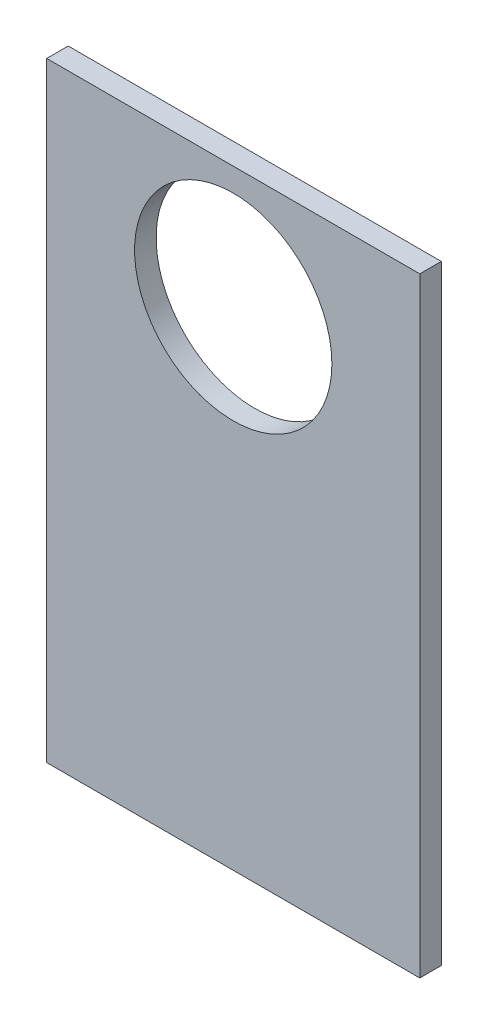
ISO-10303-21;
HEADER;
FILE_DESCRIPTION(('STEP AP214'),'2;1');
FILE_NAME('part.step','',(''),(''),'','','');
FILE_SCHEMA(('AUTOMOTIVE_DESIGN { 1 0 10303 214 1 1 1 1 }'));
ENDSEC;
DATA;
#1=APPLICATION_CONTEXT('core data for automotive mechanical design processes');
#2=APPLICATION_PROTOCOL_DEFINITION('international standard','automotive_design',2000,#1);
#3=PRODUCT_CONTEXT('',#1,'mechanical');
#4=PRODUCT('Part','Part','',(#3));
#5=PRODUCT_RELATED_PRODUCT_CATEGORY('part','',(#4));
#6=PRODUCT_DEFINITION_FORMATION('','',#4);
#7=PRODUCT_DEFINITION_CONTEXT('part definition',#1,'design');
#8=PRODUCT_DEFINITION('design','',#6,#7);
#9=PRODUCT_DEFINITION_SHAPE('','',#8);
#10=(LENGTH_UNIT() NAMED_UNIT(*) SI_UNIT(.MILLI.,.METRE.));
#11=(NAMED_UNIT(*) PLANE_ANGLE_UNIT() SI_UNIT($,.RADIAN.));
#12=(NAMED_UNIT(*) SI_UNIT($,.STERADIAN.) SOLID_ANGLE_UNIT());
#13=UNCERTAINTY_MEASURE_WITH_UNIT(LENGTH_MEASURE(1.E-05),#10,'distance_accuracy_value','');
#14=(GEOMETRIC_REPRESENTATION_CONTEXT(3) GLOBAL_UNCERTAINTY_ASSIGNED_CONTEXT((#13)) GLOBAL_UNIT_ASSIGNED_CONTEXT((#10,
#11,#12)) REPRESENTATION_CONTEXT('',''));
#15=CARTESIAN_POINT('',(0.,0.,0.));
#16=DIRECTION('',(0.,0.,1.));
#17=DIRECTION('',(1.,0.,0.));
#18=AXIS2_PLACEMENT_3D('',#15,#16,#17);
#19=CARTESIAN_POINT('',(26.0000000000001,-10.,33.));
#20=DIRECTION('',(1.,0.,0.));
#21=DIRECTION('',(0.,1.,0.));
#22=AXIS2_PLACEMENT_3D('',#19,#20,#21);
#23=PLANE('',#22);
#24=DIRECTION('',(0.,0.,1.));
#25=VECTOR('',#24,1.);
#26=CARTESIAN_POINT('',(26.0000000000001,-95.,33.));
#27=LINE('',#26,#25);
#28=CARTESIAN_POINT('',(26.0000000000001,-95.,30.));
#29=VERTEX_POINT('',#28);
#30=CARTESIAN_POINT('',(26.0000000000001,-95.,33.));
#31=VERTEX_POINT('',#30);
#32=EDGE_CURVE('E11',#29,#31,#27,.T.);
#33=ORIENTED_EDGE('',*,*,#32,.F.);
#34=DIRECTION('',(0.,1.,0.));
#35=VECTOR('',#34,1.);
#36=CARTESIAN_POINT('',(26.0000000000001,0.,30.));
#37=LINE('',#36,#35);
#38=CARTESIAN_POINT('',(26.0000000000001,-10.,30.));
#39=VERTEX_POINT('',#38);
#40=EDGE_CURVE('E93',#29,#39,#37,.T.);
#41=ORIENTED_EDGE('',*,*,#40,.T.);
#42=DIRECTION('',(0.,0.,1.));
#43=VECTOR('',#42,1.);
#44=CARTESIAN_POINT('',(26.0000000000001,-10.,33.));
#45=LINE('',#44,#43);
#46=CARTESIAN_POINT('',(26.0000000000001,-10.,33.));
#47=VERTEX_POINT('',#46);
#48=EDGE_CURVE('E47',#39,#47,#45,.T.);
#49=ORIENTED_EDGE('',*,*,#48,.T.);
#50=DIRECTION('',(0.,1.,0.));
#51=VECTOR('',#50,1.);
#52=CARTESIAN_POINT('',(26.0000000000001,-10.,33.));
#53=LINE('',#52,#51);
#54=EDGE_CURVE('E109',#31,#47,#53,.T.);
#55=ORIENTED_EDGE('',*,*,#54,.F.);
#56=EDGE_LOOP('',(#33,#41,#49,#55));
#57=FACE_BOUND('',#56,.T.);
#58=ADVANCED_FACE('F37',(#57),#23,.T.);
#59=CARTESIAN_POINT('',(-25.9999999999999,-10.,33.));
#60=DIRECTION('',(0.,1.,0.));
#61=DIRECTION('',(-1.,0.,0.));
#62=AXIS2_PLACEMENT_3D('',#59,#60,#61);
#63=PLANE('',#62);
#64=ORIENTED_EDGE('',*,*,#48,.F.);
#65=DIRECTION('',(1.,0.,0.));
#66=VECTOR('',#65,1.);
#67=CARTESIAN_POINT('',(0.,-10.,30.));
#68=LINE('',#67,#66);
#69=CARTESIAN_POINT('',(-25.9999999999999,-10.,30.));
#70=VERTEX_POINT('',#69);
#71=EDGE_CURVE('E100',#39,#70,#68,.F.);
#72=ORIENTED_EDGE('',*,*,#71,.T.);
#73=DIRECTION('',(0.,0.,1.));
#74=VECTOR('',#73,1.);
#75=CARTESIAN_POINT('',(-25.9999999999999,-10.,33.));
#76=LINE('',#75,#74);
#77=CARTESIAN_POINT('',(-25.9999999999999,-10.,33.));
#78=VERTEX_POINT('',#77);
#79=EDGE_CURVE('E55',#70,#78,#76,.T.);
#80=ORIENTED_EDGE('',*,*,#79,.T.);
#81=DIRECTION('',(-1.,0.,0.));
#82=VECTOR('',#81,1.);
#83=CARTESIAN_POINT('',(-25.9999999999999,-10.,33.));
#84=LINE('',#83,#82);
#85=EDGE_CURVE('E114',#47,#78,#84,.T.);
#86=ORIENTED_EDGE('',*,*,#85,.F.);
#87=EDGE_LOOP('',(#64,#72,#80,#86));
#88=FACE_BOUND('',#87,.T.);
#89=ADVANCED_FACE('F116',(#88),#63,.T.);
#90=CARTESIAN_POINT('',(-25.9999999999999,-10.,33.));
#91=DIRECTION('',(-1.,0.,0.));
#92=DIRECTION('',(0.,-1.,0.));
#93=AXIS2_PLACEMENT_3D('',#90,#91,#92);
#94=PLANE('',#93);
#95=ORIENTED_EDGE('',*,*,#79,.F.);
#96=DIRECTION('',(0.,1.,0.));
#97=VECTOR('',#96,1.);
#98=CARTESIAN_POINT('',(-25.9999999999999,0.,30.));
#99=LINE('',#98,#97);
#100=CARTESIAN_POINT('',(-25.9999999999999,-95.,30.));
#101=VERTEX_POINT('',#100);
#102=EDGE_CURVE('E92',#70,#101,#99,.F.);
#103=ORIENTED_EDGE('',*,*,#102,.T.);
#104=DIRECTION('',(0.,0.,1.));
#105=VECTOR('',#104,1.);
#106=CARTESIAN_POINT('',(-25.9999999999999,-95.,33.));
#107=LINE('',#106,#105);
#108=CARTESIAN_POINT('',(-25.9999999999999,-95.,33.));
#109=VERTEX_POINT('',#108);
#110=EDGE_CURVE('E41',#101,#109,#107,.T.);
#111=ORIENTED_EDGE('',*,*,#110,.T.);
#112=DIRECTION('',(0.,-1.,0.));
#113=VECTOR('',#112,1.);
#114=CARTESIAN_POINT('',(-25.9999999999999,-10.,33.));
#115=LINE('',#114,#113);
#116=EDGE_CURVE('E106',#78,#109,#115,.T.);
#117=ORIENTED_EDGE('',*,*,#116,.F.);
#118=EDGE_LOOP('',(#95,#103,#111,#117));
#119=FACE_BOUND('',#118,.T.);
#120=ADVANCED_FACE('F95',(#119),#94,.T.);
#121=CARTESIAN_POINT('',(-25.9999999999999,-95.,33.));
#122=DIRECTION('',(0.,-1.,0.));
#123=DIRECTION('',(1.,0.,0.));
#124=AXIS2_PLACEMENT_3D('',#121,#122,#123);
#125=PLANE('',#124);
#126=DIRECTION('',(1.,0.,0.));
#127=VECTOR('',#126,1.);
#128=CARTESIAN_POINT('',(0.,-95.,30.));
#129=LINE('',#128,#127);
#130=EDGE_CURVE('E80',#101,#29,#129,.T.);
#131=ORIENTED_EDGE('',*,*,#130,.T.);
#132=ORIENTED_EDGE('',*,*,#32,.T.);
#133=DIRECTION('',(1.,0.,0.));
#134=VECTOR('',#133,1.);
#135=CARTESIAN_POINT('',(-25.9999999999999,-95.,33.));
#136=LINE('',#135,#134);
#137=EDGE_CURVE('E82',#109,#31,#136,.T.);
#138=ORIENTED_EDGE('',*,*,#137,.F.);
#139=ORIENTED_EDGE('',*,*,#110,.F.);
#140=EDGE_LOOP('',(#131,#132,#138,#139));
#141=FACE_BOUND('',#140,.T.);
#142=ADVANCED_FACE('F79',(#141),#125,.T.);
#143=CARTESIAN_POINT('',(0.,-27.,33.));
#144=DIRECTION('',(0.,0.,1.));
#145=DIRECTION('',(1.,0.,0.));
#146=AXIS2_PLACEMENT_3D('',#143,#144,#145);
#147=CYLINDRICAL_SURFACE('',#146,13.75);
#148=CARTESIAN_POINT('',(0.,-27.,33.));
#149=DIRECTION('',(0.,0.,1.));
#150=DIRECTION('',(1.,0.,0.));
#151=AXIS2_PLACEMENT_3D('',#148,#149,#150);
#152=CIRCLE('',#151,13.75);
#153=CARTESIAN_POINT('',(13.75,-27.,33.));
#154=VERTEX_POINT('',#153);
#155=EDGE_CURVE('E86',#154,#154,#152,.T.);
#156=ORIENTED_EDGE('',*,*,#155,.T.);
#157=EDGE_LOOP('',(#156));
#158=FACE_BOUND('',#157,.T.);
#159=CARTESIAN_POINT('',(0.,-27.,30.));
#160=DIRECTION('',(0.,0.,1.));
#161=DIRECTION('',(1.,0.,0.));
#162=AXIS2_PLACEMENT_3D('',#159,#160,#161);
#163=CIRCLE('',#162,13.75);
#164=CARTESIAN_POINT('',(13.75,-27.,30.));
#165=VERTEX_POINT('',#164);
#166=EDGE_CURVE('E102',#165,#165,#163,.T.);
#167=ORIENTED_EDGE('',*,*,#166,.F.);
#168=EDGE_LOOP('',(#167));
#169=FACE_BOUND('',#168,.T.);
#170=ADVANCED_FACE('F39',(#158,#169),#147,.F.);
#171=CARTESIAN_POINT('',(0.,0.,33.));
#172=DIRECTION('',(0.,0.,1.));
#173=DIRECTION('',(1.,0.,0.));
#174=AXIS2_PLACEMENT_3D('',#171,#172,#173);
#175=PLANE('',#174);
#176=ORIENTED_EDGE('',*,*,#116,.T.);
#177=ORIENTED_EDGE('',*,*,#137,.T.);
#178=ORIENTED_EDGE('',*,*,#54,.T.);
#179=ORIENTED_EDGE('',*,*,#85,.T.);
#180=EDGE_LOOP('',(#176,#177,#178,#179));
#181=FACE_BOUND('',#180,.T.);
#182=ORIENTED_EDGE('',*,*,#155,.F.);
#183=EDGE_LOOP('',(#182));
#184=FACE_BOUND('',#183,.T.);
#185=ADVANCED_FACE('F112',(#181,#184),#175,.T.);
#186=CARTESIAN_POINT('',(0.,0.,30.));
#187=DIRECTION('',(0.,0.,1.));
#188=DIRECTION('',(1.,0.,0.));
#189=AXIS2_PLACEMENT_3D('',#186,#187,#188);
#190=PLANE('',#189);
#191=ORIENTED_EDGE('',*,*,#102,.F.);
#192=ORIENTED_EDGE('',*,*,#71,.F.);
#193=ORIENTED_EDGE('',*,*,#40,.F.);
#194=ORIENTED_EDGE('',*,*,#130,.F.);
#195=EDGE_LOOP('',(#191,#192,#193,#194));
#196=FACE_BOUND('',#195,.T.);
#197=ORIENTED_EDGE('',*,*,#166,.T.);
#198=EDGE_LOOP('',(#197));
#199=FACE_BOUND('',#198,.T.);
#200=ADVANCED_FACE('F89',(#196,#199),#190,.F.);
#201=CLOSED_SHELL('',(#58,#89,#120,#142,#170,#185,#200));
#202=MANIFOLD_SOLID_BREP('B2',#201);
#203=ADVANCED_BREP_SHAPE_REPRESENTATION('',(#18,#202),#14);
#204=SHAPE_DEFINITION_REPRESENTATION(#9,#203);
ENDSEC;
END-ISO-10303-21;
